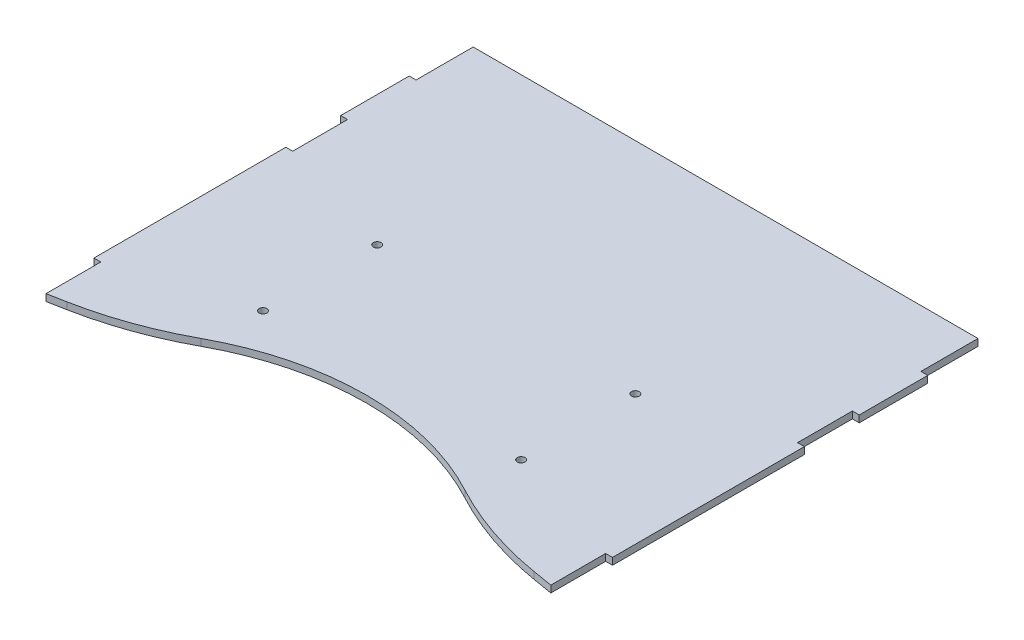
ISO-10303-21;
HEADER;
FILE_DESCRIPTION(('STEP AP214'),'2;1');
FILE_NAME('part.step','',(''),(''),'','','');
FILE_SCHEMA(('AUTOMOTIVE_DESIGN { 1 0 10303 214 1 1 1 1 }'));
ENDSEC;
DATA;
#1=APPLICATION_CONTEXT('core data for automotive mechanical design processes');
#2=APPLICATION_PROTOCOL_DEFINITION('international standard','automotive_design',2000,#1);
#3=PRODUCT_CONTEXT('',#1,'mechanical');
#4=PRODUCT('Part','Part','',(#3));
#5=PRODUCT_RELATED_PRODUCT_CATEGORY('part','',(#4));
#6=PRODUCT_DEFINITION_FORMATION('','',#4);
#7=PRODUCT_DEFINITION_CONTEXT('part definition',#1,'design');
#8=PRODUCT_DEFINITION('design','',#6,#7);
#9=PRODUCT_DEFINITION_SHAPE('','',#8);
#10=(LENGTH_UNIT() NAMED_UNIT(*) SI_UNIT(.MILLI.,.METRE.));
#11=(NAMED_UNIT(*) PLANE_ANGLE_UNIT() SI_UNIT($,.RADIAN.));
#12=(NAMED_UNIT(*) SI_UNIT($,.STERADIAN.) SOLID_ANGLE_UNIT());
#13=UNCERTAINTY_MEASURE_WITH_UNIT(LENGTH_MEASURE(1.E-05),#10,'distance_accuracy_value','');
#14=(GEOMETRIC_REPRESENTATION_CONTEXT(3) GLOBAL_UNCERTAINTY_ASSIGNED_CONTEXT((#13)) GLOBAL_UNIT_ASSIGNED_CONTEXT((#10,
#11,#12)) REPRESENTATION_CONTEXT('',''));
#15=CARTESIAN_POINT('',(0.,0.,0.));
#16=DIRECTION('',(0.,0.,1.));
#17=DIRECTION('',(1.,0.,0.));
#18=AXIS2_PLACEMENT_3D('',#15,#16,#17);
#19=CARTESIAN_POINT('',(-119.988319576707,3.,-50.7864686488141));
#20=DIRECTION('',(0.,1.,0.));
#21=DIRECTION('',(0.,0.,1.));
#22=AXIS2_PLACEMENT_3D('',#19,#20,#21);
#23=PLANE('',#22);
#24=CARTESIAN_POINT('',(67.6229243621729,3.,56.9943063968676));
#25=DIRECTION('',(0.,1.,0.));
#26=DIRECTION('',(0.,0.,1.));
#27=AXIS2_PLACEMENT_3D('',#24,#25,#26);
#28=CIRCLE('',#27,1.70000000000836);
#29=CARTESIAN_POINT('',(67.6229243621729,3.,58.694306396876));
#30=VERTEX_POINT('',#29);
#31=EDGE_CURVE('E457',#30,#30,#28,.T.);
#32=ORIENTED_EDGE('',*,*,#31,.F.);
#33=EDGE_LOOP('',(#32));
#34=FACE_BOUND('',#33,.T.);
#35=CARTESIAN_POINT('',(-45.3780371580943,3.,56.9943063968676));
#36=DIRECTION('',(0.,1.,0.));
#37=DIRECTION('',(0.,0.,-1.));
#38=AXIS2_PLACEMENT_3D('',#35,#36,#37);
#39=CIRCLE('',#38,1.70000000000835);
#40=CARTESIAN_POINT('',(-45.3780371580943,3.,55.2943063968593));
#41=VERTEX_POINT('',#40);
#42=EDGE_CURVE('E240',#41,#41,#39,.T.);
#43=ORIENTED_EDGE('',*,*,#42,.F.);
#44=EDGE_LOOP('',(#43));
#45=FACE_BOUND('',#44,.T.);
#46=DIRECTION('',(1.,0.,0.));
#47=VECTOR('',#46,1.);
#48=CARTESIAN_POINT('',(121.622443602039,3.,-34.0058768468031));
#49=LINE('',#48,#47);
#50=CARTESIAN_POINT('',(121.622443602039,3.,-34.0058768468031));
#51=VERTEX_POINT('',#50);
#52=CARTESIAN_POINT('',(124.622443602039,3.,-34.0058768468031));
#53=VERTEX_POINT('',#52);
#54=EDGE_CURVE('E283',#51,#53,#49,.T.);
#55=ORIENTED_EDGE('',*,*,#54,.T.);
#56=DIRECTION('',(0.,0.,-1.));
#57=VECTOR('',#56,1.);
#58=CARTESIAN_POINT('',(124.622443602039,3.,-34.0058768468031));
#59=LINE('',#58,#57);
#60=CARTESIAN_POINT('',(124.622443602039,3.,-64.0058768468031));
#61=VERTEX_POINT('',#60);
#62=EDGE_CURVE('E151',#53,#61,#59,.T.);
#63=ORIENTED_EDGE('',*,*,#62,.T.);
#64=DIRECTION('',(-1.,0.,0.));
#65=VECTOR('',#64,1.);
#66=CARTESIAN_POINT('',(124.622443602039,3.,-64.0058768468031));
#67=LINE('',#66,#65);
#68=CARTESIAN_POINT('',(121.622443602039,3.,-64.0058768468031));
#69=VERTEX_POINT('',#68);
#70=EDGE_CURVE('E346',#61,#69,#67,.T.);
#71=ORIENTED_EDGE('',*,*,#70,.T.);
#72=DIRECTION('',(0.,0.,-1.));
#73=VECTOR('',#72,1.);
#74=CARTESIAN_POINT('',(121.622443602039,3.,-64.0058768468031));
#75=LINE('',#74,#73);
#76=CARTESIAN_POINT('',(121.622443602039,3.,-89.0051120694086));
#77=VERTEX_POINT('',#76);
#78=EDGE_CURVE('E365',#69,#77,#75,.T.);
#79=ORIENTED_EDGE('',*,*,#78,.T.);
#80=DIRECTION('',(-0.999999999994578,0.,-3.29287633006143E-06));
#81=VECTOR('',#80,1.);
#82=CARTESIAN_POINT('',(-99.3775563979607,3.,-89.0058397950775));
#83=LINE('',#82,#81);
#84=CARTESIAN_POINT('',(-99.3775563979607,3.,-89.0058397950775));
#85=VERTEX_POINT('',#84);
#86=EDGE_CURVE('E362',#77,#85,#83,.T.);
#87=ORIENTED_EDGE('',*,*,#86,.T.);
#88=DIRECTION('',(0.,0.,1.));
#89=VECTOR('',#88,1.);
#90=CARTESIAN_POINT('',(-99.3775563979607,3.,-64.0058768468031));
#91=LINE('',#90,#89);
#92=CARTESIAN_POINT('',(-99.3775563979607,3.,-64.0058768468031));
#93=VERTEX_POINT('',#92);
#94=EDGE_CURVE('E364',#85,#93,#91,.T.);
#95=ORIENTED_EDGE('',*,*,#94,.T.);
#96=DIRECTION('',(-1.,0.,0.));
#97=VECTOR('',#96,1.);
#98=CARTESIAN_POINT('',(-102.377556397961,3.,-64.0058768468031));
#99=LINE('',#98,#97);
#100=CARTESIAN_POINT('',(-102.377556397961,3.,-64.0058768468031));
#101=VERTEX_POINT('',#100);
#102=EDGE_CURVE('E367',#93,#101,#99,.T.);
#103=ORIENTED_EDGE('',*,*,#102,.T.);
#104=DIRECTION('',(0.,0.,1.));
#105=VECTOR('',#104,1.);
#106=CARTESIAN_POINT('',(-102.377556397961,3.,-34.0058768468031));
#107=LINE('',#106,#105);
#108=CARTESIAN_POINT('',(-102.377556397961,3.,-34.0058768468031));
#109=VERTEX_POINT('',#108);
#110=EDGE_CURVE('E373',#101,#109,#107,.T.);
#111=ORIENTED_EDGE('',*,*,#110,.T.);
#112=DIRECTION('',(1.,0.,0.));
#113=VECTOR('',#112,1.);
#114=CARTESIAN_POINT('',(-99.3775563979607,3.,-34.0058768468031));
#115=LINE('',#114,#113);
#116=CARTESIAN_POINT('',(-99.3775563979607,3.,-34.0058768468031));
#117=VERTEX_POINT('',#116);
#118=EDGE_CURVE('E375',#109,#117,#115,.T.);
#119=ORIENTED_EDGE('',*,*,#118,.T.);
#120=DIRECTION('',(0.,0.,1.));
#121=VECTOR('',#120,1.);
#122=CARTESIAN_POINT('',(-99.3775563979607,3.,-10.0058768468031));
#123=LINE('',#122,#121);
#124=CARTESIAN_POINT('',(-99.3775563979607,3.,-10.0058768468031));
#125=VERTEX_POINT('',#124);
#126=EDGE_CURVE('E377',#117,#125,#123,.T.);
#127=ORIENTED_EDGE('',*,*,#126,.T.);
#128=DIRECTION('',(-1.,0.,0.));
#129=VECTOR('',#128,1.);
#130=CARTESIAN_POINT('',(-99.3775563979607,3.,-10.0058768468031));
#131=LINE('',#130,#129);
#132=CARTESIAN_POINT('',(-102.377556397961,3.,-10.0058768468031));
#133=VERTEX_POINT('',#132);
#134=EDGE_CURVE('E379',#125,#133,#131,.T.);
#135=ORIENTED_EDGE('',*,*,#134,.T.);
#136=DIRECTION('',(0.,0.,1.));
#137=VECTOR('',#136,1.);
#138=CARTESIAN_POINT('',(-102.377556397961,3.,-10.0058768468031));
#139=LINE('',#138,#137);
#140=CARTESIAN_POINT('',(-102.377556397961,3.,73.9941231531969));
#141=VERTEX_POINT('',#140);
#142=EDGE_CURVE('E381',#133,#141,#139,.T.);
#143=ORIENTED_EDGE('',*,*,#142,.T.);
#144=DIRECTION('',(1.,0.,0.));
#145=VECTOR('',#144,1.);
#146=CARTESIAN_POINT('',(-102.377556397961,3.,73.9941231531969));
#147=LINE('',#146,#145);
#148=CARTESIAN_POINT('',(-99.3775563979607,3.,73.9941231531969));
#149=VERTEX_POINT('',#148);
#150=EDGE_CURVE('E383',#141,#149,#147,.T.);
#151=ORIENTED_EDGE('',*,*,#150,.T.);
#152=DIRECTION('',(0.,0.,1.));
#153=VECTOR('',#152,1.);
#154=CARTESIAN_POINT('',(-99.3775563979607,3.,73.9941231531969));
#155=LINE('',#154,#153);
#156=CARTESIAN_POINT('',(-99.3775563979607,3.,97.9941231531969));
#157=VERTEX_POINT('',#156);
#158=EDGE_CURVE('E385',#149,#157,#155,.T.);
#159=ORIENTED_EDGE('',*,*,#158,.T.);
#160=DIRECTION('',(0.982108036493537,0.,-0.188318359845262));
#161=VECTOR('',#160,1.);
#162=CARTESIAN_POINT('',(-99.3775563979607,3.,97.9941231531969));
#163=LINE('',#162,#161);
#164=CARTESIAN_POINT('',(-91.7405655999169,3.,96.5297368252164));
#165=VERTEX_POINT('',#164);
#166=EDGE_CURVE('E387',#157,#165,#163,.T.);
#167=ORIENTED_EDGE('',*,*,#166,.T.);
#168=CARTESIAN_POINT('',(-119.988319576707,3.,-50.7864686488141));
#169=DIRECTION('',(0.,1.,0.));
#170=DIRECTION('',(0.,0.,1.));
#171=AXIS2_PLACEMENT_3D('',#168,#169,#170);
#172=CIRCLE('',#171,150.);
#173=CARTESIAN_POINT('',(-48.3937251013015,3.,81.0248132731151));
#174=VERTEX_POINT('',#173);
#175=EDGE_CURVE('E389',#165,#174,#172,.T.);
#176=ORIENTED_EDGE('',*,*,#175,.T.);
#177=CARTESIAN_POINT('',(9.42789835659181,3.,187.478971811722));
#178=DIRECTION('',(0.,-1.,0.));
#179=DIRECTION('',(0.,0.,1.));
#180=AXIS2_PLACEMENT_3D('',#177,#178,#179);
#181=CIRCLE('',#180,121.143831908476);
#182=CARTESIAN_POINT('',(66.7383594456825,3.,80.7487555689677));
#183=VERTEX_POINT('',#182);
#184=EDGE_CURVE('E391',#174,#183,#181,.T.);
#185=ORIENTED_EDGE('',*,*,#184,.T.);
#186=CARTESIAN_POINT('',(137.700033910943,3.,-51.4043403353141));
#187=DIRECTION('',(0.,1.,0.));
#188=DIRECTION('',(0.,0.,-1.));
#189=AXIS2_PLACEMENT_3D('',#186,#187,#188);
#190=CIRCLE('',#189,150.);
#191=CARTESIAN_POINT('',(112.890583802926,3.,96.5297368252164));
#192=VERTEX_POINT('',#191);
#193=EDGE_CURVE('E393',#183,#192,#190,.T.);
#194=ORIENTED_EDGE('',*,*,#193,.T.);
#195=DIRECTION('',(0.986227181070204,0.,0.165396334053447));
#196=VECTOR('',#195,1.);
#197=CARTESIAN_POINT('',(121.622443602039,3.,97.9941231531969));
#198=LINE('',#197,#196);
#199=CARTESIAN_POINT('',(121.622443602039,3.,97.9941231531969));
#200=VERTEX_POINT('',#199);
#201=EDGE_CURVE('E395',#192,#200,#198,.T.);
#202=ORIENTED_EDGE('',*,*,#201,.T.);
#203=DIRECTION('',(0.,0.,-1.));
#204=VECTOR('',#203,1.);
#205=CARTESIAN_POINT('',(121.622443602039,3.,73.9941231531969));
#206=LINE('',#205,#204);
#207=CARTESIAN_POINT('',(121.622443602039,3.,73.9941231531969));
#208=VERTEX_POINT('',#207);
#209=EDGE_CURVE('E397',#200,#208,#206,.T.);
#210=ORIENTED_EDGE('',*,*,#209,.T.);
#211=DIRECTION('',(1.,0.,0.));
#212=VECTOR('',#211,1.);
#213=CARTESIAN_POINT('',(124.622443602039,3.,73.9941231531969));
#214=LINE('',#213,#212);
#215=CARTESIAN_POINT('',(124.622443602039,3.,73.9941231531969));
#216=VERTEX_POINT('',#215);
#217=EDGE_CURVE('E218',#208,#216,#214,.T.);
#218=ORIENTED_EDGE('',*,*,#217,.T.);
#219=DIRECTION('',(0.,0.,-1.));
#220=VECTOR('',#219,1.);
#221=CARTESIAN_POINT('',(124.622443602039,3.,-10.0058768468031));
#222=LINE('',#221,#220);
#223=CARTESIAN_POINT('',(124.622443602039,3.,-10.0058768468031));
#224=VERTEX_POINT('',#223);
#225=EDGE_CURVE('E212',#216,#224,#222,.T.);
#226=ORIENTED_EDGE('',*,*,#225,.T.);
#227=DIRECTION('',(-1.,0.,0.));
#228=VECTOR('',#227,1.);
#229=CARTESIAN_POINT('',(121.622443602039,3.,-10.0058768468031));
#230=LINE('',#229,#228);
#231=CARTESIAN_POINT('',(121.622443602039,3.,-10.0058768468031));
#232=VERTEX_POINT('',#231);
#233=EDGE_CURVE('E216',#224,#232,#230,.T.);
#234=ORIENTED_EDGE('',*,*,#233,.T.);
#235=DIRECTION('',(0.,0.,-1.));
#236=VECTOR('',#235,1.);
#237=CARTESIAN_POINT('',(121.622443602039,3.,-10.0058768468031));
#238=LINE('',#237,#236);
#239=EDGE_CURVE('E60',#232,#51,#238,.T.);
#240=ORIENTED_EDGE('',*,*,#239,.T.);
#241=EDGE_LOOP('',(#55,#63,#71,#79,#87,#95,#103,#111,#119,#127,#135,#143,#151,#159,#167,#176,
#185,#194,#202,#210,#218,#226,#234,#240));
#242=FACE_BOUND('',#241,.T.);
#243=CARTESIAN_POINT('',(67.6227597183561,3.,6.99430639713869));
#244=DIRECTION('',(0.,1.,0.));
#245=DIRECTION('',(0.,0.,1.));
#246=AXIS2_PLACEMENT_3D('',#243,#244,#245);
#247=CIRCLE('',#246,1.69999999999292);
#248=CARTESIAN_POINT('',(67.6227597183561,3.,8.6943063971316));
#249=VERTEX_POINT('',#248);
#250=EDGE_CURVE('E463',#249,#249,#247,.T.);
#251=ORIENTED_EDGE('',*,*,#250,.F.);
#252=EDGE_LOOP('',(#251));
#253=FACE_BOUND('',#252,.T.);
#254=CARTESIAN_POINT('',(-45.3778725142775,3.,6.99430639713869));
#255=DIRECTION('',(0.,1.,0.));
#256=DIRECTION('',(0.,0.,-1.));
#257=AXIS2_PLACEMENT_3D('',#254,#255,#256);
#258=CIRCLE('',#257,1.69999999999292);
#259=CARTESIAN_POINT('',(-45.3778725142775,3.,5.29430639714577));
#260=VERTEX_POINT('',#259);
#261=EDGE_CURVE('E448',#260,#260,#258,.T.);
#262=ORIENTED_EDGE('',*,*,#261,.F.);
#263=EDGE_LOOP('',(#262));
#264=FACE_BOUND('',#263,.T.);
#265=ADVANCED_FACE('F43',(#34,#45,#242,#253,#264),#23,.T.);
#266=CARTESIAN_POINT('',(-119.988319576707,0.,-50.7864686488141));
#267=DIRECTION('',(0.,1.,0.));
#268=DIRECTION('',(0.,0.,1.));
#269=AXIS2_PLACEMENT_3D('',#266,#267,#268);
#270=PLANE('',#269);
#271=DIRECTION('',(1.,0.,0.));
#272=VECTOR('',#271,1.);
#273=CARTESIAN_POINT('',(121.622443602039,0.,-34.0058768468031));
#274=LINE('',#273,#272);
#275=CARTESIAN_POINT('',(121.622443602039,0.,-34.0058768468031));
#276=VERTEX_POINT('',#275);
#277=CARTESIAN_POINT('',(124.622443602039,0.,-34.0058768468031));
#278=VERTEX_POINT('',#277);
#279=EDGE_CURVE('E236',#276,#278,#274,.T.);
#280=ORIENTED_EDGE('',*,*,#279,.F.);
#281=DIRECTION('',(0.,0.,-1.));
#282=VECTOR('',#281,1.);
#283=CARTESIAN_POINT('',(121.622443602039,0.,-10.0058768468031));
#284=LINE('',#283,#282);
#285=CARTESIAN_POINT('',(121.622443602039,0.,-10.0058768468031));
#286=VERTEX_POINT('',#285);
#287=EDGE_CURVE('E143',#286,#276,#284,.T.);
#288=ORIENTED_EDGE('',*,*,#287,.F.);
#289=DIRECTION('',(-1.,0.,0.));
#290=VECTOR('',#289,1.);
#291=CARTESIAN_POINT('',(121.622443602039,0.,-10.0058768468031));
#292=LINE('',#291,#290);
#293=CARTESIAN_POINT('',(124.622443602039,0.,-10.0058768468031));
#294=VERTEX_POINT('',#293);
#295=EDGE_CURVE('E137',#294,#286,#292,.T.);
#296=ORIENTED_EDGE('',*,*,#295,.F.);
#297=DIRECTION('',(0.,0.,-1.));
#298=VECTOR('',#297,1.);
#299=CARTESIAN_POINT('',(124.622443602039,0.,-10.0058768468031));
#300=LINE('',#299,#298);
#301=CARTESIAN_POINT('',(124.622443602039,0.,73.9941231531969));
#302=VERTEX_POINT('',#301);
#303=EDGE_CURVE('E226',#302,#294,#300,.T.);
#304=ORIENTED_EDGE('',*,*,#303,.F.);
#305=DIRECTION('',(1.,0.,0.));
#306=VECTOR('',#305,1.);
#307=CARTESIAN_POINT('',(124.622443602039,0.,73.9941231531969));
#308=LINE('',#307,#306);
#309=CARTESIAN_POINT('',(121.622443602039,0.,73.9941231531969));
#310=VERTEX_POINT('',#309);
#311=EDGE_CURVE('E278',#310,#302,#308,.T.);
#312=ORIENTED_EDGE('',*,*,#311,.F.);
#313=DIRECTION('',(0.,0.,-1.));
#314=VECTOR('',#313,1.);
#315=CARTESIAN_POINT('',(121.622443602039,0.,73.9941231531969));
#316=LINE('',#315,#314);
#317=CARTESIAN_POINT('',(121.622443602039,0.,97.9941231531969));
#318=VERTEX_POINT('',#317);
#319=EDGE_CURVE('E276',#318,#310,#316,.T.);
#320=ORIENTED_EDGE('',*,*,#319,.F.);
#321=DIRECTION('',(0.986227181070204,0.,0.165396334053447));
#322=VECTOR('',#321,1.);
#323=CARTESIAN_POINT('',(121.622443602039,0.,97.9941231531969));
#324=LINE('',#323,#322);
#325=CARTESIAN_POINT('',(112.890583802926,0.,96.5297368252164));
#326=VERTEX_POINT('',#325);
#327=EDGE_CURVE('E274',#326,#318,#324,.T.);
#328=ORIENTED_EDGE('',*,*,#327,.F.);
#329=CARTESIAN_POINT('',(137.700033910943,0.,-51.4043403353141));
#330=DIRECTION('',(0.,1.,0.));
#331=DIRECTION('',(0.,0.,-1.));
#332=AXIS2_PLACEMENT_3D('',#329,#330,#331);
#333=CIRCLE('',#332,150.);
#334=CARTESIAN_POINT('',(66.7383594456825,0.,80.7487555689677));
#335=VERTEX_POINT('',#334);
#336=EDGE_CURVE('E272',#335,#326,#333,.T.);
#337=ORIENTED_EDGE('',*,*,#336,.F.);
#338=CARTESIAN_POINT('',(9.42789835659181,0.,187.478971811722));
#339=DIRECTION('',(0.,-1.,0.));
#340=DIRECTION('',(0.,0.,1.));
#341=AXIS2_PLACEMENT_3D('',#338,#339,#340);
#342=CIRCLE('',#341,121.143831908476);
#343=CARTESIAN_POINT('',(-48.3937251013015,0.,81.0248132731151));
#344=VERTEX_POINT('',#343);
#345=EDGE_CURVE('E270',#344,#335,#342,.T.);
#346=ORIENTED_EDGE('',*,*,#345,.F.);
#347=CARTESIAN_POINT('',(-119.988319576707,0.,-50.7864686488141));
#348=DIRECTION('',(0.,1.,0.));
#349=DIRECTION('',(0.,0.,1.));
#350=AXIS2_PLACEMENT_3D('',#347,#348,#349);
#351=CIRCLE('',#350,150.);
#352=CARTESIAN_POINT('',(-91.7405655999169,0.,96.5297368252164));
#353=VERTEX_POINT('',#352);
#354=EDGE_CURVE('E268',#353,#344,#351,.T.);
#355=ORIENTED_EDGE('',*,*,#354,.F.);
#356=DIRECTION('',(0.982108036493537,0.,-0.188318359845262));
#357=VECTOR('',#356,1.);
#358=CARTESIAN_POINT('',(-99.3775563979607,0.,97.9941231531969));
#359=LINE('',#358,#357);
#360=CARTESIAN_POINT('',(-99.3775563979607,0.,97.9941231531969));
#361=VERTEX_POINT('',#360);
#362=EDGE_CURVE('E266',#361,#353,#359,.T.);
#363=ORIENTED_EDGE('',*,*,#362,.F.);
#364=DIRECTION('',(0.,0.,1.));
#365=VECTOR('',#364,1.);
#366=CARTESIAN_POINT('',(-99.3775563979607,0.,73.9941231531969));
#367=LINE('',#366,#365);
#368=CARTESIAN_POINT('',(-99.3775563979607,0.,73.9941231531969));
#369=VERTEX_POINT('',#368);
#370=EDGE_CURVE('E264',#369,#361,#367,.T.);
#371=ORIENTED_EDGE('',*,*,#370,.F.);
#372=DIRECTION('',(1.,0.,0.));
#373=VECTOR('',#372,1.);
#374=CARTESIAN_POINT('',(-102.377556397961,0.,73.9941231531969));
#375=LINE('',#374,#373);
#376=CARTESIAN_POINT('',(-102.377556397961,0.,73.9941231531969));
#377=VERTEX_POINT('',#376);
#378=EDGE_CURVE('E262',#377,#369,#375,.T.);
#379=ORIENTED_EDGE('',*,*,#378,.F.);
#380=DIRECTION('',(0.,0.,1.));
#381=VECTOR('',#380,1.);
#382=CARTESIAN_POINT('',(-102.377556397961,0.,-10.0058768468031));
#383=LINE('',#382,#381);
#384=CARTESIAN_POINT('',(-102.377556397961,0.,-10.0058768468031));
#385=VERTEX_POINT('',#384);
#386=EDGE_CURVE('E260',#385,#377,#383,.T.);
#387=ORIENTED_EDGE('',*,*,#386,.F.);
#388=DIRECTION('',(-1.,0.,0.));
#389=VECTOR('',#388,1.);
#390=CARTESIAN_POINT('',(-99.3775563979607,0.,-10.0058768468031));
#391=LINE('',#390,#389);
#392=CARTESIAN_POINT('',(-99.3775563979607,0.,-10.0058768468031));
#393=VERTEX_POINT('',#392);
#394=EDGE_CURVE('E258',#393,#385,#391,.T.);
#395=ORIENTED_EDGE('',*,*,#394,.F.);
#396=DIRECTION('',(0.,0.,1.));
#397=VECTOR('',#396,1.);
#398=CARTESIAN_POINT('',(-99.3775563979607,0.,-10.0058768468031));
#399=LINE('',#398,#397);
#400=CARTESIAN_POINT('',(-99.3775563979607,0.,-34.0058768468031));
#401=VERTEX_POINT('',#400);
#402=EDGE_CURVE('E256',#401,#393,#399,.T.);
#403=ORIENTED_EDGE('',*,*,#402,.F.);
#404=DIRECTION('',(1.,0.,0.));
#405=VECTOR('',#404,1.);
#406=CARTESIAN_POINT('',(-99.3775563979607,0.,-34.0058768468031));
#407=LINE('',#406,#405);
#408=CARTESIAN_POINT('',(-102.377556397961,0.,-34.0058768468031));
#409=VERTEX_POINT('',#408);
#410=EDGE_CURVE('E254',#409,#401,#407,.T.);
#411=ORIENTED_EDGE('',*,*,#410,.F.);
#412=DIRECTION('',(0.,0.,1.));
#413=VECTOR('',#412,1.);
#414=CARTESIAN_POINT('',(-102.377556397961,0.,-34.0058768468031));
#415=LINE('',#414,#413);
#416=CARTESIAN_POINT('',(-102.377556397961,0.,-64.0058768468031));
#417=VERTEX_POINT('',#416);
#418=EDGE_CURVE('E252',#417,#409,#415,.T.);
#419=ORIENTED_EDGE('',*,*,#418,.F.);
#420=DIRECTION('',(-1.,0.,0.));
#421=VECTOR('',#420,1.);
#422=CARTESIAN_POINT('',(-102.377556397961,0.,-64.0058768468031));
#423=LINE('',#422,#421);
#424=CARTESIAN_POINT('',(-99.3775563979607,0.,-64.0058768468031));
#425=VERTEX_POINT('',#424);
#426=EDGE_CURVE('E250',#425,#417,#423,.T.);
#427=ORIENTED_EDGE('',*,*,#426,.F.);
#428=DIRECTION('',(0.,0.,1.));
#429=VECTOR('',#428,1.);
#430=CARTESIAN_POINT('',(-99.3775563979607,0.,-64.0058768468031));
#431=LINE('',#430,#429);
#432=CARTESIAN_POINT('',(-99.3775563979607,0.,-89.0058397950775));
#433=VERTEX_POINT('',#432);
#434=EDGE_CURVE('E248',#433,#425,#431,.T.);
#435=ORIENTED_EDGE('',*,*,#434,.F.);
#436=DIRECTION('',(-0.999999999994578,0.,-3.29287633006143E-06));
#437=VECTOR('',#436,1.);
#438=CARTESIAN_POINT('',(-99.3775563979607,0.,-89.0058397950775));
#439=LINE('',#438,#437);
#440=CARTESIAN_POINT('',(121.622443602039,0.,-89.0051120694086));
#441=VERTEX_POINT('',#440);
#442=EDGE_CURVE('E246',#441,#433,#439,.T.);
#443=ORIENTED_EDGE('',*,*,#442,.F.);
#444=DIRECTION('',(0.,0.,-1.));
#445=VECTOR('',#444,1.);
#446=CARTESIAN_POINT('',(121.622443602039,0.,-64.0058768468031));
#447=LINE('',#446,#445);
#448=CARTESIAN_POINT('',(121.622443602039,0.,-64.0058768468031));
#449=VERTEX_POINT('',#448);
#450=EDGE_CURVE('E244',#449,#441,#447,.T.);
#451=ORIENTED_EDGE('',*,*,#450,.F.);
#452=DIRECTION('',(-1.,0.,0.));
#453=VECTOR('',#452,1.);
#454=CARTESIAN_POINT('',(124.622443602039,0.,-64.0058768468031));
#455=LINE('',#454,#453);
#456=CARTESIAN_POINT('',(124.622443602039,0.,-64.0058768468031));
#457=VERTEX_POINT('',#456);
#458=EDGE_CURVE('E242',#457,#449,#455,.T.);
#459=ORIENTED_EDGE('',*,*,#458,.F.);
#460=DIRECTION('',(0.,0.,-1.));
#461=VECTOR('',#460,1.);
#462=CARTESIAN_POINT('',(124.622443602039,0.,-34.0058768468031));
#463=LINE('',#462,#461);
#464=EDGE_CURVE('E239',#278,#457,#463,.T.);
#465=ORIENTED_EDGE('',*,*,#464,.F.);
#466=EDGE_LOOP('',(#280,#288,#296,#304,#312,#320,#328,#337,#346,#355,#363,#371,#379,#387,#395,
#403,#411,#419,#427,#435,#443,#451,#459,#465));
#467=FACE_BOUND('',#466,.T.);
#468=CARTESIAN_POINT('',(-45.3780371580943,0.,56.9943063968676));
#469=DIRECTION('',(0.,1.,0.));
#470=DIRECTION('',(0.,0.,-1.));
#471=AXIS2_PLACEMENT_3D('',#468,#469,#470);
#472=CIRCLE('',#471,1.70000000000835);
#473=CARTESIAN_POINT('',(-45.3780371580943,0.,55.2943063968593));
#474=VERTEX_POINT('',#473);
#475=EDGE_CURVE('E466',#474,#474,#472,.T.);
#476=ORIENTED_EDGE('',*,*,#475,.T.);
#477=EDGE_LOOP('',(#476));
#478=FACE_BOUND('',#477,.T.);
#479=CARTESIAN_POINT('',(67.6227597183561,0.,6.99430639713869));
#480=DIRECTION('',(0.,1.,0.));
#481=DIRECTION('',(0.,0.,1.));
#482=AXIS2_PLACEMENT_3D('',#479,#480,#481);
#483=CIRCLE('',#482,1.69999999999292);
#484=CARTESIAN_POINT('',(67.6227597183561,0.,8.6943063971316));
#485=VERTEX_POINT('',#484);
#486=EDGE_CURVE('E460',#485,#485,#483,.T.);
#487=ORIENTED_EDGE('',*,*,#486,.T.);
#488=EDGE_LOOP('',(#487));
#489=FACE_BOUND('',#488,.T.);
#490=CARTESIAN_POINT('',(67.6229243621729,0.,56.9943063968676));
#491=DIRECTION('',(0.,1.,0.));
#492=DIRECTION('',(0.,0.,1.));
#493=AXIS2_PLACEMENT_3D('',#490,#491,#492);
#494=CIRCLE('',#493,1.70000000000836);
#495=CARTESIAN_POINT('',(67.6229243621729,0.,58.694306396876));
#496=VERTEX_POINT('',#495);
#497=EDGE_CURVE('E454',#496,#496,#494,.T.);
#498=ORIENTED_EDGE('',*,*,#497,.T.);
#499=EDGE_LOOP('',(#498));
#500=FACE_BOUND('',#499,.T.);
#501=CARTESIAN_POINT('',(-45.3778725142775,0.,6.99430639713869));
#502=DIRECTION('',(0.,1.,0.));
#503=DIRECTION('',(0.,0.,-1.));
#504=AXIS2_PLACEMENT_3D('',#501,#502,#503);
#505=CIRCLE('',#504,1.69999999999292);
#506=CARTESIAN_POINT('',(-45.3778725142775,0.,5.29430639714577));
#507=VERTEX_POINT('',#506);
#508=EDGE_CURVE('E451',#507,#507,#505,.T.);
#509=ORIENTED_EDGE('',*,*,#508,.T.);
#510=EDGE_LOOP('',(#509));
#511=FACE_BOUND('',#510,.T.);
#512=ADVANCED_FACE('F350',(#467,#478,#489,#500,#511),#270,.F.);
#513=CARTESIAN_POINT('',(121.622443602039,3.,-34.0058768468031));
#514=DIRECTION('',(0.,0.,-1.));
#515=DIRECTION('',(-1.,0.,0.));
#516=AXIS2_PLACEMENT_3D('',#513,#514,#515);
#517=PLANE('',#516);
#518=ORIENTED_EDGE('',*,*,#279,.T.);
#519=DIRECTION('',(0.,-1.,0.));
#520=VECTOR('',#519,1.);
#521=CARTESIAN_POINT('',(124.622443602039,3.,-34.0058768468031));
#522=LINE('',#521,#520);
#523=EDGE_CURVE('E11',#53,#278,#522,.T.);
#524=ORIENTED_EDGE('',*,*,#523,.F.);
#525=ORIENTED_EDGE('',*,*,#54,.F.);
#526=DIRECTION('',(0.,-1.,0.));
#527=VECTOR('',#526,1.);
#528=CARTESIAN_POINT('',(121.622443602039,3.,-34.0058768468031));
#529=LINE('',#528,#527);
#530=EDGE_CURVE('E232',#51,#276,#529,.T.);
#531=ORIENTED_EDGE('',*,*,#530,.T.);
#532=EDGE_LOOP('',(#518,#524,#525,#531));
#533=FACE_BOUND('',#532,.T.);
#534=ADVANCED_FACE('F45',(#533),#517,.F.);
#535=CARTESIAN_POINT('',(124.622443602039,3.,-34.0058768468031));
#536=DIRECTION('',(-1.,0.,0.));
#537=DIRECTION('',(0.,0.,1.));
#538=AXIS2_PLACEMENT_3D('',#535,#536,#537);
#539=PLANE('',#538);
#540=ORIENTED_EDGE('',*,*,#464,.T.);
#541=DIRECTION('',(0.,-1.,0.));
#542=VECTOR('',#541,1.);
#543=CARTESIAN_POINT('',(124.622443602039,3.,-64.0058768468031));
#544=LINE('',#543,#542);
#545=EDGE_CURVE('E52',#61,#457,#544,.T.);
#546=ORIENTED_EDGE('',*,*,#545,.F.);
#547=ORIENTED_EDGE('',*,*,#62,.F.);
#548=ORIENTED_EDGE('',*,*,#523,.T.);
#549=EDGE_LOOP('',(#540,#546,#547,#548));
#550=FACE_BOUND('',#549,.T.);
#551=ADVANCED_FACE('F700',(#550),#539,.F.);
#552=CARTESIAN_POINT('',(124.622443602039,3.,-64.0058768468031));
#553=DIRECTION('',(0.,0.,1.));
#554=DIRECTION('',(1.,0.,0.));
#555=AXIS2_PLACEMENT_3D('',#552,#553,#554);
#556=PLANE('',#555);
#557=ORIENTED_EDGE('',*,*,#458,.T.);
#558=DIRECTION('',(0.,-1.,0.));
#559=VECTOR('',#558,1.);
#560=CARTESIAN_POINT('',(121.622443602039,3.,-64.0058768468031));
#561=LINE('',#560,#559);
#562=EDGE_CURVE('E338',#69,#449,#561,.T.);
#563=ORIENTED_EDGE('',*,*,#562,.F.);
#564=ORIENTED_EDGE('',*,*,#70,.F.);
#565=ORIENTED_EDGE('',*,*,#545,.T.);
#566=EDGE_LOOP('',(#557,#563,#564,#565));
#567=FACE_BOUND('',#566,.T.);
#568=ADVANCED_FACE('F344',(#567),#556,.F.);
#569=CARTESIAN_POINT('',(121.622443602039,3.,-64.0058768468031));
#570=DIRECTION('',(-1.,0.,0.));
#571=DIRECTION('',(0.,0.,1.));
#572=AXIS2_PLACEMENT_3D('',#569,#570,#571);
#573=PLANE('',#572);
#574=ORIENTED_EDGE('',*,*,#450,.T.);
#575=DIRECTION('',(0.,-1.,0.));
#576=VECTOR('',#575,1.);
#577=CARTESIAN_POINT('',(121.622443602039,3.,-89.0051120694086));
#578=LINE('',#577,#576);
#579=EDGE_CURVE('E335',#77,#441,#578,.T.);
#580=ORIENTED_EDGE('',*,*,#579,.F.);
#581=ORIENTED_EDGE('',*,*,#78,.F.);
#582=ORIENTED_EDGE('',*,*,#562,.T.);
#583=EDGE_LOOP('',(#574,#580,#581,#582));
#584=FACE_BOUND('',#583,.T.);
#585=ADVANCED_FACE('F356',(#584),#573,.F.);
#586=CARTESIAN_POINT('',(-99.3775563979607,3.,-89.0058397950775));
#587=DIRECTION('',(-3.29287633006143E-06,0.,0.999999999994579));
#588=DIRECTION('',(0.999999999994579,0.,3.29287633006143E-06));
#589=AXIS2_PLACEMENT_3D('',#586,#587,#588);
#590=PLANE('',#589);
#591=ORIENTED_EDGE('',*,*,#442,.T.);
#592=DIRECTION('',(0.,-1.,0.));
#593=VECTOR('',#592,1.);
#594=CARTESIAN_POINT('',(-99.3775563979607,3.,-89.0058397950775));
#595=LINE('',#594,#593);
#596=EDGE_CURVE('E332',#85,#433,#595,.T.);
#597=ORIENTED_EDGE('',*,*,#596,.F.);
#598=ORIENTED_EDGE('',*,*,#86,.F.);
#599=ORIENTED_EDGE('',*,*,#579,.T.);
#600=EDGE_LOOP('',(#591,#597,#598,#599));
#601=FACE_BOUND('',#600,.T.);
#602=ADVANCED_FACE('F360',(#601),#590,.F.);
#603=CARTESIAN_POINT('',(-99.3775563979607,3.,-64.0058768468031));
#604=DIRECTION('',(1.,0.,0.));
#605=DIRECTION('',(0.,0.,-1.));
#606=AXIS2_PLACEMENT_3D('',#603,#604,#605);
#607=PLANE('',#606);
#608=ORIENTED_EDGE('',*,*,#434,.T.);
#609=DIRECTION('',(0.,-1.,0.));
#610=VECTOR('',#609,1.);
#611=CARTESIAN_POINT('',(-99.3775563979607,3.,-64.0058768468031));
#612=LINE('',#611,#610);
#613=EDGE_CURVE('E329',#93,#425,#612,.T.);
#614=ORIENTED_EDGE('',*,*,#613,.F.);
#615=ORIENTED_EDGE('',*,*,#94,.F.);
#616=ORIENTED_EDGE('',*,*,#596,.T.);
#617=EDGE_LOOP('',(#608,#614,#615,#616));
#618=FACE_BOUND('',#617,.T.);
#619=ADVANCED_FACE('F665',(#618),#607,.F.);
#620=CARTESIAN_POINT('',(-102.377556397961,3.,-64.0058768468031));
#621=DIRECTION('',(0.,0.,1.));
#622=DIRECTION('',(1.,0.,0.));
#623=AXIS2_PLACEMENT_3D('',#620,#621,#622);
#624=PLANE('',#623);
#625=ORIENTED_EDGE('',*,*,#426,.T.);
#626=DIRECTION('',(0.,-1.,0.));
#627=VECTOR('',#626,1.);
#628=CARTESIAN_POINT('',(-102.377556397961,3.,-64.0058768468031));
#629=LINE('',#628,#627);
#630=EDGE_CURVE('E326',#101,#417,#629,.T.);
#631=ORIENTED_EDGE('',*,*,#630,.F.);
#632=ORIENTED_EDGE('',*,*,#102,.F.);
#633=ORIENTED_EDGE('',*,*,#613,.T.);
#634=EDGE_LOOP('',(#625,#631,#632,#633));
#635=FACE_BOUND('',#634,.T.);
#636=ADVANCED_FACE('F655',(#635),#624,.F.);
#637=CARTESIAN_POINT('',(-102.377556397961,3.,-34.0058768468031));
#638=DIRECTION('',(1.,0.,0.));
#639=DIRECTION('',(0.,0.,-1.));
#640=AXIS2_PLACEMENT_3D('',#637,#638,#639);
#641=PLANE('',#640);
#642=ORIENTED_EDGE('',*,*,#418,.T.);
#643=DIRECTION('',(0.,-1.,0.));
#644=VECTOR('',#643,1.);
#645=CARTESIAN_POINT('',(-102.377556397961,3.,-34.0058768468031));
#646=LINE('',#645,#644);
#647=EDGE_CURVE('E323',#109,#409,#646,.T.);
#648=ORIENTED_EDGE('',*,*,#647,.F.);
#649=ORIENTED_EDGE('',*,*,#110,.F.);
#650=ORIENTED_EDGE('',*,*,#630,.T.);
#651=EDGE_LOOP('',(#642,#648,#649,#650));
#652=FACE_BOUND('',#651,.T.);
#653=ADVANCED_FACE('F645',(#652),#641,.F.);
#654=CARTESIAN_POINT('',(-99.3775563979607,3.,-34.0058768468031));
#655=DIRECTION('',(0.,0.,-1.));
#656=DIRECTION('',(-1.,0.,0.));
#657=AXIS2_PLACEMENT_3D('',#654,#655,#656);
#658=PLANE('',#657);
#659=ORIENTED_EDGE('',*,*,#410,.T.);
#660=DIRECTION('',(0.,-1.,0.));
#661=VECTOR('',#660,1.);
#662=CARTESIAN_POINT('',(-99.3775563979607,3.,-34.0058768468031));
#663=LINE('',#662,#661);
#664=EDGE_CURVE('E320',#117,#401,#663,.T.);
#665=ORIENTED_EDGE('',*,*,#664,.F.);
#666=ORIENTED_EDGE('',*,*,#118,.F.);
#667=ORIENTED_EDGE('',*,*,#647,.T.);
#668=EDGE_LOOP('',(#659,#665,#666,#667));
#669=FACE_BOUND('',#668,.T.);
#670=ADVANCED_FACE('F635',(#669),#658,.F.);
#671=CARTESIAN_POINT('',(-99.3775563979607,3.,-10.0058768468031));
#672=DIRECTION('',(1.,0.,0.));
#673=DIRECTION('',(0.,0.,-1.));
#674=AXIS2_PLACEMENT_3D('',#671,#672,#673);
#675=PLANE('',#674);
#676=ORIENTED_EDGE('',*,*,#402,.T.);
#677=DIRECTION('',(0.,-1.,0.));
#678=VECTOR('',#677,1.);
#679=CARTESIAN_POINT('',(-99.3775563979607,3.,-10.0058768468031));
#680=LINE('',#679,#678);
#681=EDGE_CURVE('E317',#125,#393,#680,.T.);
#682=ORIENTED_EDGE('',*,*,#681,.F.);
#683=ORIENTED_EDGE('',*,*,#126,.F.);
#684=ORIENTED_EDGE('',*,*,#664,.T.);
#685=EDGE_LOOP('',(#676,#682,#683,#684));
#686=FACE_BOUND('',#685,.T.);
#687=ADVANCED_FACE('F625',(#686),#675,.F.);
#688=CARTESIAN_POINT('',(-99.3775563979607,3.,-10.0058768468031));
#689=DIRECTION('',(0.,0.,1.));
#690=DIRECTION('',(1.,0.,0.));
#691=AXIS2_PLACEMENT_3D('',#688,#689,#690);
#692=PLANE('',#691);
#693=ORIENTED_EDGE('',*,*,#394,.T.);
#694=DIRECTION('',(0.,-1.,0.));
#695=VECTOR('',#694,1.);
#696=CARTESIAN_POINT('',(-102.377556397961,3.,-10.0058768468031));
#697=LINE('',#696,#695);
#698=EDGE_CURVE('E314',#133,#385,#697,.T.);
#699=ORIENTED_EDGE('',*,*,#698,.F.);
#700=ORIENTED_EDGE('',*,*,#134,.F.);
#701=ORIENTED_EDGE('',*,*,#681,.T.);
#702=EDGE_LOOP('',(#693,#699,#700,#701));
#703=FACE_BOUND('',#702,.T.);
#704=ADVANCED_FACE('F615',(#703),#692,.F.);
#705=CARTESIAN_POINT('',(-102.377556397961,3.,-10.0058768468031));
#706=DIRECTION('',(1.,0.,0.));
#707=DIRECTION('',(0.,0.,-1.));
#708=AXIS2_PLACEMENT_3D('',#705,#706,#707);
#709=PLANE('',#708);
#710=ORIENTED_EDGE('',*,*,#386,.T.);
#711=DIRECTION('',(0.,-1.,0.));
#712=VECTOR('',#711,1.);
#713=CARTESIAN_POINT('',(-102.377556397961,3.,73.9941231531969));
#714=LINE('',#713,#712);
#715=EDGE_CURVE('E311',#141,#377,#714,.T.);
#716=ORIENTED_EDGE('',*,*,#715,.F.);
#717=ORIENTED_EDGE('',*,*,#142,.F.);
#718=ORIENTED_EDGE('',*,*,#698,.T.);
#719=EDGE_LOOP('',(#710,#716,#717,#718));
#720=FACE_BOUND('',#719,.T.);
#721=ADVANCED_FACE('F605',(#720),#709,.F.);
#722=CARTESIAN_POINT('',(-102.377556397961,3.,73.9941231531969));
#723=DIRECTION('',(0.,0.,-1.));
#724=DIRECTION('',(-1.,0.,0.));
#725=AXIS2_PLACEMENT_3D('',#722,#723,#724);
#726=PLANE('',#725);
#727=ORIENTED_EDGE('',*,*,#378,.T.);
#728=DIRECTION('',(0.,-1.,0.));
#729=VECTOR('',#728,1.);
#730=CARTESIAN_POINT('',(-99.3775563979607,3.,73.9941231531969));
#731=LINE('',#730,#729);
#732=EDGE_CURVE('E308',#149,#369,#731,.T.);
#733=ORIENTED_EDGE('',*,*,#732,.F.);
#734=ORIENTED_EDGE('',*,*,#150,.F.);
#735=ORIENTED_EDGE('',*,*,#715,.T.);
#736=EDGE_LOOP('',(#727,#733,#734,#735));
#737=FACE_BOUND('',#736,.T.);
#738=ADVANCED_FACE('F595',(#737),#726,.F.);
#739=CARTESIAN_POINT('',(-99.3775563979607,3.,73.9941231531969));
#740=DIRECTION('',(1.,0.,0.));
#741=DIRECTION('',(0.,0.,-1.));
#742=AXIS2_PLACEMENT_3D('',#739,#740,#741);
#743=PLANE('',#742);
#744=ORIENTED_EDGE('',*,*,#370,.T.);
#745=DIRECTION('',(0.,-1.,0.));
#746=VECTOR('',#745,1.);
#747=CARTESIAN_POINT('',(-99.3775563979607,3.,97.9941231531969));
#748=LINE('',#747,#746);
#749=EDGE_CURVE('E305',#157,#361,#748,.T.);
#750=ORIENTED_EDGE('',*,*,#749,.F.);
#751=ORIENTED_EDGE('',*,*,#158,.F.);
#752=ORIENTED_EDGE('',*,*,#732,.T.);
#753=EDGE_LOOP('',(#744,#750,#751,#752));
#754=FACE_BOUND('',#753,.T.);
#755=ADVANCED_FACE('F585',(#754),#743,.F.);
#756=CARTESIAN_POINT('',(-99.3775563979607,3.,97.9941231531969));
#757=DIRECTION('',(-0.188318359845262,0.,-0.982108036493537));
#758=DIRECTION('',(-0.982108036493537,0.,0.188318359845262));
#759=AXIS2_PLACEMENT_3D('',#756,#757,#758);
#760=PLANE('',#759);
#761=ORIENTED_EDGE('',*,*,#362,.T.);
#762=DIRECTION('',(0.,-1.,0.));
#763=VECTOR('',#762,1.);
#764=CARTESIAN_POINT('',(-91.7405655999169,3.,96.5297368252164));
#765=LINE('',#764,#763);
#766=EDGE_CURVE('E302',#165,#353,#765,.T.);
#767=ORIENTED_EDGE('',*,*,#766,.F.);
#768=ORIENTED_EDGE('',*,*,#166,.F.);
#769=ORIENTED_EDGE('',*,*,#749,.T.);
#770=EDGE_LOOP('',(#761,#767,#768,#769));
#771=FACE_BOUND('',#770,.T.);
#772=ADVANCED_FACE('F575',(#771),#760,.F.);
#773=CARTESIAN_POINT('',(-119.988319576707,3.,-50.7864686488141));
#774=DIRECTION('',(0.,-1.,0.));
#775=DIRECTION('',(0.,0.,-1.));
#776=AXIS2_PLACEMENT_3D('',#773,#774,#775);
#777=CYLINDRICAL_SURFACE('',#776,150.);
#778=ORIENTED_EDGE('',*,*,#354,.T.);
#779=DIRECTION('',(0.,-1.,0.));
#780=VECTOR('',#779,1.);
#781=CARTESIAN_POINT('',(-48.3937251013015,3.,81.0248132731151));
#782=LINE('',#781,#780);
#783=EDGE_CURVE('E299',#174,#344,#782,.T.);
#784=ORIENTED_EDGE('',*,*,#783,.F.);
#785=ORIENTED_EDGE('',*,*,#175,.F.);
#786=ORIENTED_EDGE('',*,*,#766,.T.);
#787=EDGE_LOOP('',(#778,#784,#785,#786));
#788=FACE_BOUND('',#787,.T.);
#789=ADVANCED_FACE('F565',(#788),#777,.T.);
#790=CARTESIAN_POINT('',(9.42789835659181,3.,187.478971811722));
#791=DIRECTION('',(0.,-1.,0.));
#792=DIRECTION('',(0.,0.,-1.));
#793=AXIS2_PLACEMENT_3D('',#790,#791,#792);
#794=CYLINDRICAL_SURFACE('',#793,121.143831908476);
#795=ORIENTED_EDGE('',*,*,#345,.T.);
#796=DIRECTION('',(0.,-1.,0.));
#797=VECTOR('',#796,1.);
#798=CARTESIAN_POINT('',(66.7383594456825,3.,80.7487555689677));
#799=LINE('',#798,#797);
#800=EDGE_CURVE('E296',#183,#335,#799,.T.);
#801=ORIENTED_EDGE('',*,*,#800,.F.);
#802=ORIENTED_EDGE('',*,*,#184,.F.);
#803=ORIENTED_EDGE('',*,*,#783,.T.);
#804=EDGE_LOOP('',(#795,#801,#802,#803));
#805=FACE_BOUND('',#804,.T.);
#806=ADVANCED_FACE('F555',(#805),#794,.F.);
#807=CARTESIAN_POINT('',(137.700033910943,3.,-51.4043403353141));
#808=DIRECTION('',(0.,-1.,0.));
#809=DIRECTION('',(0.,0.,-1.));
#810=AXIS2_PLACEMENT_3D('',#807,#808,#809);
#811=CYLINDRICAL_SURFACE('',#810,150.);
#812=ORIENTED_EDGE('',*,*,#336,.T.);
#813=DIRECTION('',(0.,-1.,0.));
#814=VECTOR('',#813,1.);
#815=CARTESIAN_POINT('',(112.890583802926,3.,96.5297368252164));
#816=LINE('',#815,#814);
#817=EDGE_CURVE('E293',#192,#326,#816,.T.);
#818=ORIENTED_EDGE('',*,*,#817,.F.);
#819=ORIENTED_EDGE('',*,*,#193,.F.);
#820=ORIENTED_EDGE('',*,*,#800,.T.);
#821=EDGE_LOOP('',(#812,#818,#819,#820));
#822=FACE_BOUND('',#821,.T.);
#823=ADVANCED_FACE('F545',(#822),#811,.T.);
#824=CARTESIAN_POINT('',(121.622443602039,3.,97.9941231531969));
#825=DIRECTION('',(0.165396334053447,0.,-0.986227181070204));
#826=DIRECTION('',(-0.986227181070204,0.,-0.165396334053447));
#827=AXIS2_PLACEMENT_3D('',#824,#825,#826);
#828=PLANE('',#827);
#829=ORIENTED_EDGE('',*,*,#327,.T.);
#830=DIRECTION('',(0.,-1.,0.));
#831=VECTOR('',#830,1.);
#832=CARTESIAN_POINT('',(121.622443602039,3.,97.9941231531969));
#833=LINE('',#832,#831);
#834=EDGE_CURVE('E290',#200,#318,#833,.T.);
#835=ORIENTED_EDGE('',*,*,#834,.F.);
#836=ORIENTED_EDGE('',*,*,#201,.F.);
#837=ORIENTED_EDGE('',*,*,#817,.T.);
#838=EDGE_LOOP('',(#829,#835,#836,#837));
#839=FACE_BOUND('',#838,.T.);
#840=ADVANCED_FACE('F536',(#839),#828,.F.);
#841=CARTESIAN_POINT('',(121.622443602039,3.,73.9941231531969));
#842=DIRECTION('',(-1.,0.,0.));
#843=DIRECTION('',(0.,0.,1.));
#844=AXIS2_PLACEMENT_3D('',#841,#842,#843);
#845=PLANE('',#844);
#846=ORIENTED_EDGE('',*,*,#319,.T.);
#847=DIRECTION('',(0.,-1.,0.));
#848=VECTOR('',#847,1.);
#849=CARTESIAN_POINT('',(121.622443602039,3.,73.9941231531969));
#850=LINE('',#849,#848);
#851=EDGE_CURVE('E287',#208,#310,#850,.T.);
#852=ORIENTED_EDGE('',*,*,#851,.F.);
#853=ORIENTED_EDGE('',*,*,#209,.F.);
#854=ORIENTED_EDGE('',*,*,#834,.T.);
#855=EDGE_LOOP('',(#846,#852,#853,#854));
#856=FACE_BOUND('',#855,.T.);
#857=ADVANCED_FACE('F403',(#856),#845,.F.);
#858=CARTESIAN_POINT('',(124.622443602039,3.,73.9941231531969));
#859=DIRECTION('',(0.,0.,-1.));
#860=DIRECTION('',(-1.,0.,0.));
#861=AXIS2_PLACEMENT_3D('',#858,#859,#860);
#862=PLANE('',#861);
#863=ORIENTED_EDGE('',*,*,#311,.T.);
#864=DIRECTION('',(0.,-1.,0.));
#865=VECTOR('',#864,1.);
#866=CARTESIAN_POINT('',(124.622443602039,3.,73.9941231531969));
#867=LINE('',#866,#865);
#868=EDGE_CURVE('E227',#216,#302,#867,.T.);
#869=ORIENTED_EDGE('',*,*,#868,.F.);
#870=ORIENTED_EDGE('',*,*,#217,.F.);
#871=ORIENTED_EDGE('',*,*,#851,.T.);
#872=EDGE_LOOP('',(#863,#869,#870,#871));
#873=FACE_BOUND('',#872,.T.);
#874=ADVANCED_FACE('F407',(#873),#862,.F.);
#875=CARTESIAN_POINT('',(124.622443602039,3.,-10.0058768468031));
#876=DIRECTION('',(-1.,0.,0.));
#877=DIRECTION('',(0.,0.,1.));
#878=AXIS2_PLACEMENT_3D('',#875,#876,#877);
#879=PLANE('',#878);
#880=ORIENTED_EDGE('',*,*,#303,.T.);
#881=DIRECTION('',(0.,-1.,0.));
#882=VECTOR('',#881,1.);
#883=CARTESIAN_POINT('',(124.622443602039,3.,-10.0058768468031));
#884=LINE('',#883,#882);
#885=EDGE_CURVE('E223',#224,#294,#884,.T.);
#886=ORIENTED_EDGE('',*,*,#885,.F.);
#887=ORIENTED_EDGE('',*,*,#225,.F.);
#888=ORIENTED_EDGE('',*,*,#868,.T.);
#889=EDGE_LOOP('',(#880,#886,#887,#888));
#890=FACE_BOUND('',#889,.T.);
#891=ADVANCED_FACE('F224',(#890),#879,.F.);
#892=CARTESIAN_POINT('',(121.622443602039,3.,-10.0058768468031));
#893=DIRECTION('',(0.,0.,1.));
#894=DIRECTION('',(1.,0.,0.));
#895=AXIS2_PLACEMENT_3D('',#892,#893,#894);
#896=PLANE('',#895);
#897=ORIENTED_EDGE('',*,*,#295,.T.);
#898=DIRECTION('',(0.,-1.,0.));
#899=VECTOR('',#898,1.);
#900=CARTESIAN_POINT('',(121.622443602039,3.,-10.0058768468031));
#901=LINE('',#900,#899);
#902=EDGE_CURVE('E228',#232,#286,#901,.T.);
#903=ORIENTED_EDGE('',*,*,#902,.F.);
#904=ORIENTED_EDGE('',*,*,#233,.F.);
#905=ORIENTED_EDGE('',*,*,#885,.T.);
#906=EDGE_LOOP('',(#897,#903,#904,#905));
#907=FACE_BOUND('',#906,.T.);
#908=ADVANCED_FACE('F230',(#907),#896,.F.);
#909=CARTESIAN_POINT('',(121.622443602039,3.,-10.0058768468031));
#910=DIRECTION('',(-1.,0.,0.));
#911=DIRECTION('',(0.,0.,1.));
#912=AXIS2_PLACEMENT_3D('',#909,#910,#911);
#913=PLANE('',#912);
#914=ORIENTED_EDGE('',*,*,#287,.T.);
#915=ORIENTED_EDGE('',*,*,#530,.F.);
#916=ORIENTED_EDGE('',*,*,#239,.F.);
#917=ORIENTED_EDGE('',*,*,#902,.T.);
#918=EDGE_LOOP('',(#914,#915,#916,#917));
#919=FACE_BOUND('',#918,.T.);
#920=ADVANCED_FACE('F411',(#919),#913,.F.);
#921=CARTESIAN_POINT('',(-45.3780371580943,3.,56.9943063968676));
#922=DIRECTION('',(0.,-1.,0.));
#923=DIRECTION('',(0.,0.,-1.));
#924=AXIS2_PLACEMENT_3D('',#921,#922,#923);
#925=CYLINDRICAL_SURFACE('',#924,1.70000000000835);
#926=ORIENTED_EDGE('',*,*,#42,.T.);
#927=EDGE_LOOP('',(#926));
#928=FACE_BOUND('',#927,.T.);
#929=ORIENTED_EDGE('',*,*,#475,.F.);
#930=EDGE_LOOP('',(#929));
#931=FACE_BOUND('',#930,.T.);
#932=ADVANCED_FACE('F413',(#928,#931),#925,.F.);
#933=CARTESIAN_POINT('',(67.6227597183561,3.,6.99430639713869));
#934=DIRECTION('',(0.,-1.,0.));
#935=DIRECTION('',(0.,0.,-1.));
#936=AXIS2_PLACEMENT_3D('',#933,#934,#935);
#937=CYLINDRICAL_SURFACE('',#936,1.69999999999292);
#938=ORIENTED_EDGE('',*,*,#250,.T.);
#939=EDGE_LOOP('',(#938));
#940=FACE_BOUND('',#939,.T.);
#941=ORIENTED_EDGE('',*,*,#486,.F.);
#942=EDGE_LOOP('',(#941));
#943=FACE_BOUND('',#942,.T.);
#944=ADVANCED_FACE('F419',(#940,#943),#937,.F.);
#945=CARTESIAN_POINT('',(67.6229243621729,3.,56.9943063968676));
#946=DIRECTION('',(0.,-1.,0.));
#947=DIRECTION('',(0.,0.,-1.));
#948=AXIS2_PLACEMENT_3D('',#945,#946,#947);
#949=CYLINDRICAL_SURFACE('',#948,1.70000000000836);
#950=ORIENTED_EDGE('',*,*,#31,.T.);
#951=EDGE_LOOP('',(#950));
#952=FACE_BOUND('',#951,.T.);
#953=ORIENTED_EDGE('',*,*,#497,.F.);
#954=EDGE_LOOP('',(#953));
#955=FACE_BOUND('',#954,.T.);
#956=ADVANCED_FACE('F435',(#952,#955),#949,.F.);
#957=CARTESIAN_POINT('',(-45.3778725142775,3.,6.99430639713869));
#958=DIRECTION('',(0.,-1.,0.));
#959=DIRECTION('',(0.,0.,-1.));
#960=AXIS2_PLACEMENT_3D('',#957,#958,#959);
#961=CYLINDRICAL_SURFACE('',#960,1.69999999999292);
#962=ORIENTED_EDGE('',*,*,#261,.T.);
#963=EDGE_LOOP('',(#962));
#964=FACE_BOUND('',#963,.T.);
#965=ORIENTED_EDGE('',*,*,#508,.F.);
#966=EDGE_LOOP('',(#965));
#967=FACE_BOUND('',#966,.T.);
#968=ADVANCED_FACE('F439',(#964,#967),#961,.F.);
#969=CLOSED_SHELL('',(#265,#512,#534,#551,#568,#585,#602,#619,#636,#653,#670,#687,#704,#721,
#738,#755,#772,#789,#806,#823,#840,#857,#874,#891,#908,#920,#932,#944,#956,#968));
#970=MANIFOLD_SOLID_BREP('B2',#969);
#971=ADVANCED_BREP_SHAPE_REPRESENTATION('',(#18,#970),#14);
#972=SHAPE_DEFINITION_REPRESENTATION(#9,#971);
ENDSEC;
END-ISO-10303-21;
